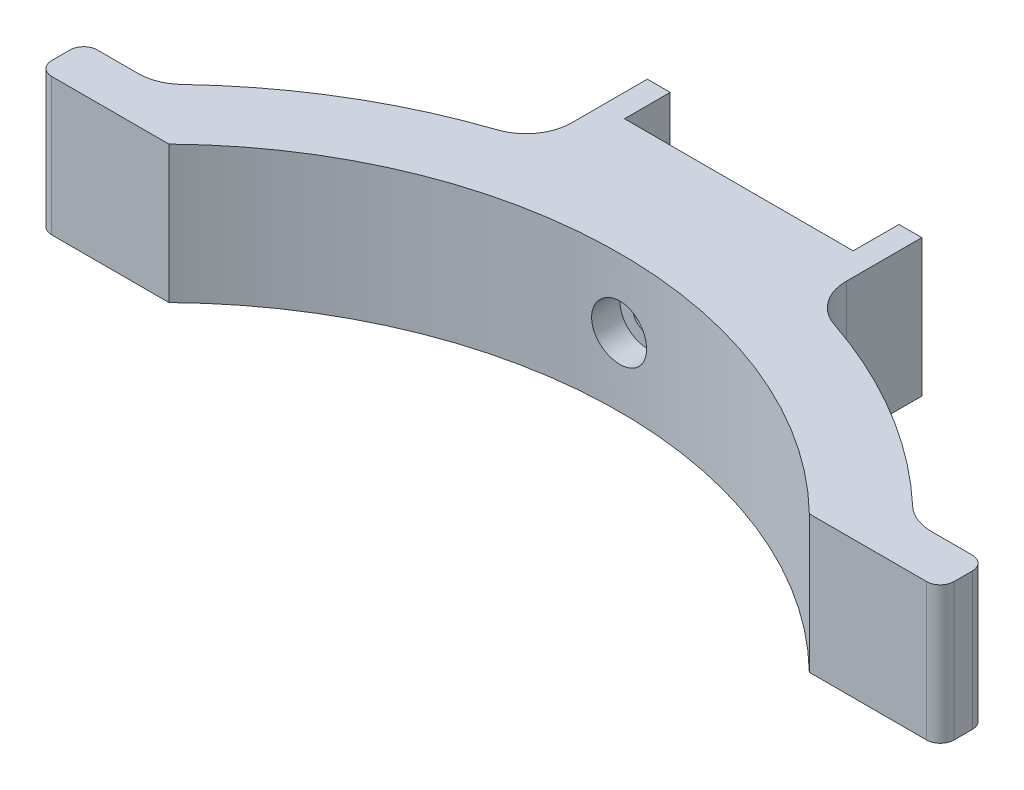
ISO-10303-21;
HEADER;
FILE_DESCRIPTION(('STEP AP214'),'2;1');
FILE_NAME('part.step','',(''),(''),'','','');
FILE_SCHEMA(('AUTOMOTIVE_DESIGN { 1 0 10303 214 1 1 1 1 }'));
ENDSEC;
DATA;
#1=APPLICATION_CONTEXT('core data for automotive mechanical design processes');
#2=APPLICATION_PROTOCOL_DEFINITION('international standard','automotive_design',2000,#1);
#3=PRODUCT_CONTEXT('',#1,'mechanical');
#4=PRODUCT('Part','Part','',(#3));
#5=PRODUCT_RELATED_PRODUCT_CATEGORY('part','',(#4));
#6=PRODUCT_DEFINITION_FORMATION('','',#4);
#7=PRODUCT_DEFINITION_CONTEXT('part definition',#1,'design');
#8=PRODUCT_DEFINITION('design','',#6,#7);
#9=PRODUCT_DEFINITION_SHAPE('','',#8);
#10=(LENGTH_UNIT() NAMED_UNIT(*) SI_UNIT(.MILLI.,.METRE.));
#11=(NAMED_UNIT(*) PLANE_ANGLE_UNIT() SI_UNIT($,.RADIAN.));
#12=(NAMED_UNIT(*) SI_UNIT($,.STERADIAN.) SOLID_ANGLE_UNIT());
#13=UNCERTAINTY_MEASURE_WITH_UNIT(LENGTH_MEASURE(1.E-05),#10,'distance_accuracy_value','');
#14=(GEOMETRIC_REPRESENTATION_CONTEXT(3) GLOBAL_UNCERTAINTY_ASSIGNED_CONTEXT((#13)) GLOBAL_UNIT_ASSIGNED_CONTEXT((#10,
#11,#12)) REPRESENTATION_CONTEXT('',''));
#15=CARTESIAN_POINT('',(0.,0.,0.));
#16=DIRECTION('',(0.,0.,1.));
#17=DIRECTION('',(1.,0.,0.));
#18=AXIS2_PLACEMENT_3D('',#15,#16,#17);
#19=CARTESIAN_POINT('',(-35.,7.5,0.));
#20=DIRECTION('',(0.,0.,-1.));
#21=DIRECTION('',(-1.,0.,0.));
#22=AXIS2_PLACEMENT_3D('',#19,#20,#21);
#23=CYLINDRICAL_SURFACE('',#22,1.6);
#24=CARTESIAN_POINT('',(-35.,7.5,-27.2928578572857));
#25=DIRECTION('',(0.,0.,-1.));
#26=DIRECTION('',(-1.,0.,0.));
#27=AXIS2_PLACEMENT_3D('',#24,#25,#26);
#28=CIRCLE('',#27,1.6);
#29=CARTESIAN_POINT('',(-36.6,7.5,-27.2928578572857));
#30=VERTEX_POINT('',#29);
#31=EDGE_CURVE('E234',#30,#30,#28,.T.);
#32=ORIENTED_EDGE('',*,*,#31,.T.);
#33=EDGE_LOOP('',(#32));
#34=FACE_BOUND('',#33,.T.);
#35=CARTESIAN_POINT('',(-35.,7.5,-17.2928578572857));
#36=DIRECTION('',(0.,0.,1.));
#37=DIRECTION('',(1.,0.,0.));
#38=AXIS2_PLACEMENT_3D('',#35,#36,#37);
#39=CIRCLE('',#38,1.6);
#40=CARTESIAN_POINT('',(-33.4,7.5,-17.2928578572857));
#41=VERTEX_POINT('',#40);
#42=EDGE_CURVE('E386',#41,#41,#39,.F.);
#43=ORIENTED_EDGE('',*,*,#42,.F.);
#44=EDGE_LOOP('',(#43));
#45=FACE_BOUND('',#44,.T.);
#46=ADVANCED_FACE('F37',(#34,#45),#23,.F.);
#47=CARTESIAN_POINT('',(0.,15.,-32.2928578572858));
#48=DIRECTION('',(0.,0.,-1.));
#49=DIRECTION('',(-1.,0.,0.));
#50=AXIS2_PLACEMENT_3D('',#47,#48,#49);
#51=PLANE('',#50);
#52=DIRECTION('',(0.,1.,0.));
#53=VECTOR('',#52,1.);
#54=CARTESIAN_POINT('',(-47.5,0.,-32.2928578572858));
#55=LINE('',#54,#53);
#56=CARTESIAN_POINT('',(-47.5,0.,-32.2928578572858));
#57=VERTEX_POINT('',#56);
#58=CARTESIAN_POINT('',(-47.5,15.,-32.2928578572858));
#59=VERTEX_POINT('',#58);
#60=EDGE_CURVE('E240',#57,#59,#55,.T.);
#61=ORIENTED_EDGE('',*,*,#60,.F.);
#62=DIRECTION('',(1.,0.,0.));
#63=VECTOR('',#62,1.);
#64=CARTESIAN_POINT('',(0.,0.,-32.2928578572858));
#65=LINE('',#64,#63);
#66=CARTESIAN_POINT('',(-50.,0.,-32.2928578572858));
#67=VERTEX_POINT('',#66);
#68=EDGE_CURVE('E228',#67,#57,#65,.T.);
#69=ORIENTED_EDGE('',*,*,#68,.F.);
#70=DIRECTION('',(0.,-1.,0.));
#71=VECTOR('',#70,1.);
#72=CARTESIAN_POINT('',(-50.,15.,-32.2928578572858));
#73=LINE('',#72,#71);
#74=CARTESIAN_POINT('',(-50.,15.,-32.2928578572858));
#75=VERTEX_POINT('',#74);
#76=EDGE_CURVE('E280',#75,#67,#73,.T.);
#77=ORIENTED_EDGE('',*,*,#76,.F.);
#78=DIRECTION('',(1.,0.,0.));
#79=VECTOR('',#78,1.);
#80=CARTESIAN_POINT('',(0.,15.,-32.2928578572858));
#81=LINE('',#80,#79);
#82=EDGE_CURVE('E274',#75,#59,#81,.T.);
#83=ORIENTED_EDGE('',*,*,#82,.T.);
#84=EDGE_LOOP('',(#61,#69,#77,#83));
#85=FACE_BOUND('',#84,.T.);
#86=ADVANCED_FACE('F409',(#85),#51,.T.);
#87=CARTESIAN_POINT('',(-35.,15.,35.7071421427143));
#88=DIRECTION('',(0.,-1.,0.));
#89=DIRECTION('',(0.,0.,-1.));
#90=AXIS2_PLACEMENT_3D('',#87,#88,#89);
#91=CYLINDRICAL_SURFACE('',#90,58.);
#92=CARTESIAN_POINT('',(-35.,0.,35.7071421427143));
#93=DIRECTION('',(0.,1.,0.));
#94=DIRECTION('',(0.,0.,1.));
#95=AXIS2_PLACEMENT_3D('',#92,#93,#94);
#96=CIRCLE('',#95,58.);
#97=CARTESIAN_POINT('',(-74.9162624278333,0.,-6.37244903629251));
#98=VERTEX_POINT('',#97);
#99=CARTESIAN_POINT('',(-53.4126984126984,0.,-19.2926081945647));
#100=VERTEX_POINT('',#99);
#101=EDGE_CURVE('E242',#98,#100,#96,.F.);
#102=ORIENTED_EDGE('',*,*,#101,.F.);
#103=DIRECTION('',(0.,-1.,0.));
#104=VECTOR('',#103,1.);
#105=CARTESIAN_POINT('',(-74.9162624278333,15.,-6.37244903629251));
#106=LINE('',#105,#104);
#107=CARTESIAN_POINT('',(-74.9162624278333,15.,-6.37244903629251));
#108=VERTEX_POINT('',#107);
#109=EDGE_CURVE('E333',#98,#108,#106,.F.);
#110=ORIENTED_EDGE('',*,*,#109,.T.);
#111=CARTESIAN_POINT('',(-35.,15.,35.7071421427143));
#112=DIRECTION('',(0.,1.,0.));
#113=DIRECTION('',(0.,0.,1.));
#114=AXIS2_PLACEMENT_3D('',#111,#112,#113);
#115=CIRCLE('',#114,58.);
#116=CARTESIAN_POINT('',(-53.4126984126984,15.,-19.2926081945647));
#117=VERTEX_POINT('',#116);
#118=EDGE_CURVE('E247',#108,#117,#115,.F.);
#119=ORIENTED_EDGE('',*,*,#118,.T.);
#120=DIRECTION('',(0.,-1.,0.));
#121=VECTOR('',#120,1.);
#122=CARTESIAN_POINT('',(-53.4126984126984,15.,-19.2926081945647));
#123=LINE('',#122,#121);
#124=EDGE_CURVE('E330',#117,#100,#123,.T.);
#125=ORIENTED_EDGE('',*,*,#124,.T.);
#126=EDGE_LOOP('',(#102,#110,#119,#125));
#127=FACE_BOUND('',#126,.T.);
#128=ADVANCED_FACE('F415',(#127),#91,.T.);
#129=CARTESIAN_POINT('',(0.,15.,-4.99999999999998));
#130=DIRECTION('',(0.,0.,1.));
#131=DIRECTION('',(1.,0.,0.));
#132=AXIS2_PLACEMENT_3D('',#129,#130,#131);
#133=PLANE('',#132);
#134=DIRECTION('',(-1.,0.,0.));
#135=VECTOR('',#134,1.);
#136=CARTESIAN_POINT('',(0.,0.,-4.99999999999998));
#137=LINE('',#136,#135);
#138=CARTESIAN_POINT('',(-78.357319533681,0.,-5.));
#139=VERTEX_POINT('',#138);
#140=CARTESIAN_POINT('',(-82.8149921768461,0.,-5.));
#141=VERTEX_POINT('',#140);
#142=EDGE_CURVE('E283',#139,#141,#137,.T.);
#143=ORIENTED_EDGE('',*,*,#142,.T.);
#144=DIRECTION('',(0.,-1.,0.));
#145=VECTOR('',#144,1.);
#146=CARTESIAN_POINT('',(-82.8149921768461,15.,-5.));
#147=LINE('',#146,#145);
#148=CARTESIAN_POINT('',(-82.8149921768461,15.,-5.));
#149=VERTEX_POINT('',#148);
#150=EDGE_CURVE('E379',#141,#149,#147,.F.);
#151=ORIENTED_EDGE('',*,*,#150,.T.);
#152=DIRECTION('',(-1.,0.,0.));
#153=VECTOR('',#152,1.);
#154=CARTESIAN_POINT('',(0.,15.,-4.99999999999998));
#155=LINE('',#154,#153);
#156=CARTESIAN_POINT('',(-78.357319533681,15.,-5.));
#157=VERTEX_POINT('',#156);
#158=EDGE_CURVE('E250',#157,#149,#155,.T.);
#159=ORIENTED_EDGE('',*,*,#158,.F.);
#160=DIRECTION('',(0.,-1.,0.));
#161=VECTOR('',#160,1.);
#162=CARTESIAN_POINT('',(-78.357319533681,15.,-5.));
#163=LINE('',#162,#161);
#164=EDGE_CURVE('E327',#157,#139,#163,.T.);
#165=ORIENTED_EDGE('',*,*,#164,.T.);
#166=EDGE_LOOP('',(#143,#151,#159,#165));
#167=FACE_BOUND('',#166,.T.);
#168=ADVANCED_FACE('F470',(#167),#133,.F.);
#169=CARTESIAN_POINT('',(-84.3149921768461,15.,0.));
#170=DIRECTION('',(1.,0.,0.));
#171=DIRECTION('',(0.,0.,-1.));
#172=AXIS2_PLACEMENT_3D('',#169,#170,#171);
#173=PLANE('',#172);
#174=DIRECTION('',(0.,0.,1.));
#175=VECTOR('',#174,1.);
#176=CARTESIAN_POINT('',(-84.3149921768461,0.,0.));
#177=LINE('',#176,#175);
#178=CARTESIAN_POINT('',(-84.3149921768461,0.,-3.5));
#179=VERTEX_POINT('',#178);
#180=CARTESIAN_POINT('',(-84.3149921768461,0.,-1.5));
#181=VERTEX_POINT('',#180);
#182=EDGE_CURVE('E287',#179,#181,#177,.T.);
#183=ORIENTED_EDGE('',*,*,#182,.T.);
#184=DIRECTION('',(0.,-1.,0.));
#185=VECTOR('',#184,1.);
#186=CARTESIAN_POINT('',(-84.3149921768461,15.,-1.5));
#187=LINE('',#186,#185);
#188=CARTESIAN_POINT('',(-84.3149921768461,15.,-1.5));
#189=VERTEX_POINT('',#188);
#190=EDGE_CURVE('E370',#181,#189,#187,.F.);
#191=ORIENTED_EDGE('',*,*,#190,.T.);
#192=DIRECTION('',(0.,0.,1.));
#193=VECTOR('',#192,1.);
#194=CARTESIAN_POINT('',(-84.3149921768461,15.,0.));
#195=LINE('',#194,#193);
#196=CARTESIAN_POINT('',(-84.3149921768461,15.,-3.5));
#197=VERTEX_POINT('',#196);
#198=EDGE_CURVE('E255',#197,#189,#195,.T.);
#199=ORIENTED_EDGE('',*,*,#198,.F.);
#200=DIRECTION('',(0.,-1.,0.));
#201=VECTOR('',#200,1.);
#202=CARTESIAN_POINT('',(-84.3149921768461,15.,-3.5));
#203=LINE('',#202,#201);
#204=EDGE_CURVE('E367',#197,#179,#203,.T.);
#205=ORIENTED_EDGE('',*,*,#204,.T.);
#206=EDGE_LOOP('',(#183,#191,#199,#205));
#207=FACE_BOUND('',#206,.T.);
#208=ADVANCED_FACE('F466',(#207),#173,.F.);
#209=CARTESIAN_POINT('',(0.,15.,0.));
#210=DIRECTION('',(0.,0.,-1.));
#211=DIRECTION('',(-1.,0.,0.));
#212=AXIS2_PLACEMENT_3D('',#209,#210,#211);
#213=PLANE('',#212);
#214=DIRECTION('',(1.,0.,0.));
#215=VECTOR('',#214,1.);
#216=CARTESIAN_POINT('',(0.,15.,0.));
#217=LINE('',#216,#215);
#218=CARTESIAN_POINT('',(-82.8149921768461,15.,0.));
#219=VERTEX_POINT('',#218);
#220=CARTESIAN_POINT('',(-70.,15.,0.));
#221=VERTEX_POINT('',#220);
#222=EDGE_CURVE('E258',#219,#221,#217,.T.);
#223=ORIENTED_EDGE('',*,*,#222,.F.);
#224=DIRECTION('',(0.,-1.,0.));
#225=VECTOR('',#224,1.);
#226=CARTESIAN_POINT('',(-82.8149921768461,15.,0.));
#227=LINE('',#226,#225);
#228=CARTESIAN_POINT('',(-82.8149921768461,0.,0.));
#229=VERTEX_POINT('',#228);
#230=EDGE_CURVE('E356',#219,#229,#227,.T.);
#231=ORIENTED_EDGE('',*,*,#230,.T.);
#232=DIRECTION('',(1.,0.,0.));
#233=VECTOR('',#232,1.);
#234=CARTESIAN_POINT('',(0.,0.,0.));
#235=LINE('',#234,#233);
#236=CARTESIAN_POINT('',(-70.,0.,0.));
#237=VERTEX_POINT('',#236);
#238=EDGE_CURVE('E290',#229,#237,#235,.T.);
#239=ORIENTED_EDGE('',*,*,#238,.T.);
#240=DIRECTION('',(0.,-1.,0.));
#241=VECTOR('',#240,1.);
#242=CARTESIAN_POINT('',(-70.,15.,0.));
#243=LINE('',#242,#241);
#244=EDGE_CURVE('E317',#221,#237,#243,.T.);
#245=ORIENTED_EDGE('',*,*,#244,.F.);
#246=EDGE_LOOP('',(#223,#231,#239,#245));
#247=FACE_BOUND('',#246,.T.);
#248=ADVANCED_FACE('F462',(#247),#213,.F.);
#249=CARTESIAN_POINT('',(-35.,15.,35.7071421427143));
#250=DIRECTION('',(0.,-1.,0.));
#251=DIRECTION('',(0.,0.,-1.));
#252=AXIS2_PLACEMENT_3D('',#249,#250,#251);
#253=CYLINDRICAL_SURFACE('',#252,50.);
#254=CARTESIAN_POINT('',(-32.,7.5,-14.2027767111569));
#255=CARTESIAN_POINT('',(-32.0000074126429,7.66834851500796,-14.2027779173491));
#256=CARTESIAN_POINT('',(-32.0142182255217,7.83681523704035,-14.2036376412121));
#257=CARTESIAN_POINT('',(-32.070704515842,8.16909784742341,-14.2069840899649));
#258=CARTESIAN_POINT('',(-32.1130127467532,8.33290807497459,-14.2094727136323));
#259=CARTESIAN_POINT('',(-32.2244751100488,8.65101638142346,-14.215794062862));
#260=CARTESIAN_POINT('',(-32.2936151774535,8.80531939488397,-14.2196260841273));
#261=CARTESIAN_POINT('',(-32.4567560762598,9.10008901450537,-14.2282015550612));
#262=CARTESIAN_POINT('',(-32.550751176806,9.24055879997698,-14.2329447945602));
#263=CARTESIAN_POINT('',(-32.7610782359146,9.5039113338983,-14.2428157517169));
#264=CARTESIAN_POINT('',(-32.8774375224599,9.62677224113994,-14.2479439350367));
#265=CARTESIAN_POINT('',(-33.1291338642861,9.85123266182081,-14.2580026036015));
#266=CARTESIAN_POINT('',(-33.2644717070366,9.95283129259662,-14.2629330806322));
#267=CARTESIAN_POINT('',(-33.5504046495832,10.1319486820872,-14.2720446989564));
#268=CARTESIAN_POINT('',(-33.701010932928,10.2094496186989,-14.2762252846852));
#269=CARTESIAN_POINT('',(-34.0131270968661,10.3380574838814,-14.2833611914971));
#270=CARTESIAN_POINT('',(-34.1746368681849,10.3891646769251,-14.2863165248575));
#271=CARTESIAN_POINT('',(-34.5037671344434,10.4634743912151,-14.2906657288223));
#272=CARTESIAN_POINT('',(-34.6713799612553,10.4867107632927,-14.2920614934777));
#273=CARTESIAN_POINT('',(-35.008132393482,10.5047237618644,-14.2931406581224));
#274=CARTESIAN_POINT('',(-35.1772719827989,10.4995006880759,-14.2928240761452));
#275=CARTESIAN_POINT('',(-35.5120474182026,10.4607710179149,-14.290515804139));
#276=CARTESIAN_POINT('',(-35.6776874943814,10.4273008396841,-14.2885262710076));
#277=CARTESIAN_POINT('',(-36.0009940116487,10.333083557326,-14.283098592828));
#278=CARTESIAN_POINT('',(-36.158660408559,10.2723363020886,-14.2796604397548));
#279=CARTESIAN_POINT('',(-36.4616609796574,10.1252479570604,-14.2717189592381));
#280=CARTESIAN_POINT('',(-36.6069871140227,10.0388903439208,-14.2672149444997));
#281=CARTESIAN_POINT('',(-36.8810940674377,9.84304468960387,-14.2576487036315));
#282=CARTESIAN_POINT('',(-37.0098747153707,9.7335564092356,-14.2525864717296));
#283=CARTESIAN_POINT('',(-37.2474476095389,9.49435166581447,-14.2424641758901));
#284=CARTESIAN_POINT('',(-37.3562080352986,9.36460359617032,-14.2374041279418));
#285=CARTESIAN_POINT('',(-37.5504078806733,9.08867314529296,-14.2278646507134));
#286=CARTESIAN_POINT('',(-37.6358472917606,8.94249075805027,-14.2233852216458));
#287=CARTESIAN_POINT('',(-37.7809774184875,8.63782124992027,-14.2155127660071));
#288=CARTESIAN_POINT('',(-37.8406668251299,8.47933350397517,-14.2121197946683));
#289=CARTESIAN_POINT('',(-37.9325807658974,8.15456130681087,-14.2068048851309));
#290=CARTESIAN_POINT('',(-37.9648055976735,7.98827694010918,-14.20488293099));
#291=CARTESIAN_POINT('',(-38.0008360624559,7.65290918846178,-14.2027297779876));
#292=CARTESIAN_POINT('',(-38.00468591307,7.48383057021174,-14.2024959484811));
#293=CARTESIAN_POINT('',(-37.9839726323076,7.14742991891693,-14.2037385429101));
#294=CARTESIAN_POINT('',(-37.9594096370208,6.98010787746252,-14.2052149586541));
#295=CARTESIAN_POINT('',(-37.8826046361301,6.65209489821447,-14.2097092535134));
#296=CARTESIAN_POINT('',(-37.8303829677351,6.4913991815897,-14.2127259999769));
#297=CARTESIAN_POINT('',(-37.6997635980336,6.1810529754805,-14.2199600191421));
#298=CARTESIAN_POINT('',(-37.6213656779736,6.03140257831397,-14.2241773018765));
#299=CARTESIAN_POINT('',(-37.4405061331126,5.74719185710485,-14.2333435115505));
#300=CARTESIAN_POINT('',(-37.338014864049,5.61265042680334,-14.2382933370028));
#301=CARTESIAN_POINT('',(-37.1119211530436,5.36266704611566,-14.2483636617502));
#302=CARTESIAN_POINT('',(-36.9883185200426,5.24722526860115,-14.2534841625894));
#303=CARTESIAN_POINT('',(-36.7233204847152,5.03856897183482,-14.2633264916511));
#304=CARTESIAN_POINT('',(-36.5819025394137,4.9453830549062,-14.2680478018725));
#305=CARTESIAN_POINT('',(-36.2854017066771,4.78407936716542,-14.2765522920794));
#306=CARTESIAN_POINT('',(-36.1303188981623,4.7159614515867,-14.2803354774824));
#307=CARTESIAN_POINT('',(-35.8109959952124,4.60677719297666,-14.286534943987));
#308=CARTESIAN_POINT('',(-35.6467621234427,4.56569270511091,-14.2889521417853));
#309=CARTESIAN_POINT('',(-35.3137124435243,4.51168215005503,-14.292150909441));
#310=CARTESIAN_POINT('',(-35.1448966762788,4.49875583157688,-14.292932493895));
#311=CARTESIAN_POINT('',(-34.8077585335077,4.50143095968146,-14.2927720133574));
#312=CARTESIAN_POINT('',(-34.6394357995064,4.51698762213074,-14.2918326542247));
#313=CARTESIAN_POINT('',(-34.3077968618993,4.57609432098125,-14.2883413114521));
#314=CARTESIAN_POINT('',(-34.144480667249,4.61964440745322,-14.2857893249278));
#315=CARTESIAN_POINT('',(-33.8274834984612,4.73349180325337,-14.2793596279586));
#316=CARTESIAN_POINT('',(-33.6738024909268,4.80378901986656,-14.2754819221091));
#317=CARTESIAN_POINT('',(-33.3804190108313,4.96912871185856,-14.2668363210219));
#318=CARTESIAN_POINT('',(-33.2407161613912,5.06417051982503,-14.2620684497948));
#319=CARTESIAN_POINT('',(-32.9790280774797,5.27646617125653,-14.25217005238));
#320=CARTESIAN_POINT('',(-32.8570689717361,5.39375219719127,-14.2470390075869));
#321=CARTESIAN_POINT('',(-32.6345297287572,5.64716738910832,-14.2369966014822));
#322=CARTESIAN_POINT('',(-32.5339548369549,5.78330116485217,-14.2320852943038));
#323=CARTESIAN_POINT('',(-32.3569704773385,6.07069248995209,-14.2230319200712));
#324=CARTESIAN_POINT('',(-32.2805896482858,6.2219676858121,-14.2188907670316));
#325=CARTESIAN_POINT('',(-32.1544039551781,6.53510923970906,-14.211858394132));
#326=CARTESIAN_POINT('',(-32.1045679067453,6.69696291811898,-14.2089657083546));
#327=CARTESIAN_POINT('',(-32.045865327022,6.96650850653592,-14.2055173136294));
#328=CARTESIAN_POINT('',(-32.0286880089385,7.07245726973714,-14.2044941671315));
#329=CARTESIAN_POINT('',(-32.0057529919403,7.28558803715451,-14.2031234821815));
#330=CARTESIAN_POINT('',(-31.9999952785006,7.39277003980188,-14.2027759428701));
#331=CARTESIAN_POINT('',(-32.,7.5,-14.2027767111569));
#332=B_SPLINE_CURVE_WITH_KNOTS('',3,(#254,#255,#256,#257,#258,#259,#260,#261,#262,#263,#264,
#265,#266,#267,#268,#269,#270,#271,#272,#273,#274,#275,#276,#277,#278,#279,#280,#281,#282,#283,
#284,#285,#286,#287,#288,#289,#290,#291,#292,#293,#294,#295,#296,#297,#298,#299,#300,#301,#302,
#303,#304,#305,#306,#307,#308,#309,#310,#311,#312,#313,#314,#315,#316,#317,#318,#319,#320,#321,
#322,#323,#324,#325,#326,#327,#328,#329,#330,#331),.UNSPECIFIED.,.T.,.F.,(4,2,2,2,2,2,2,2,2,2,2,
2,2,2,2,2,2,2,2,2,2,2,2,2,2,2,2,2,2,2,2,2,2,2,2,2,2,2,4),(0.,0.50465409441083,1.00989750469077,
1.51487642839874,2.01973901987436,2.52522249762361,3.03072695540781,3.53660438832692,
4.04247675211105,4.54773407852321,5.05298608388374,5.5575876764176,6.06219206439061,
6.56712272507959,7.07205860744166,7.5777902413209,8.08352206012947,8.58927958470435,
9.0950316279961,9.59999537532428,10.1049567040272,10.6095472529766,11.1141420188672,
11.619360913985,12.1245843816075,12.630453689427,13.1363200758289,13.6418465774614,
14.147368567676,14.6520964020586,15.1568251392307,15.6615521268506,16.1662655023596,
16.6717147352076,17.1772878093688,17.6834571183417,18.1890304689197,18.5104714230321,
18.8319119682899),.UNSPECIFIED.);
#333=CARTESIAN_POINT('',(-32.,7.5,-14.2027767111569));
#334=VERTEX_POINT('',#333);
#335=EDGE_CURVE('E41',#334,#334,#332,.T.);
#336=ORIENTED_EDGE('',*,*,#335,.F.);
#337=EDGE_LOOP('',(#336));
#338=FACE_BOUND('',#337,.T.);
#339=CARTESIAN_POINT('',(-35.,0.,35.7071421427143));
#340=DIRECTION('',(0.,1.,0.));
#341=DIRECTION('',(0.,0.,1.));
#342=AXIS2_PLACEMENT_3D('',#339,#340,#341);
#343=CIRCLE('',#342,50.);
#344=CARTESIAN_POINT('',(0.,0.,0.));
#345=VERTEX_POINT('',#344);
#346=EDGE_CURVE('E292',#345,#237,#343,.T.);
#347=ORIENTED_EDGE('',*,*,#346,.F.);
#348=DIRECTION('',(0.,-1.,0.));
#349=VECTOR('',#348,1.);
#350=CARTESIAN_POINT('',(0.,15.,0.));
#351=LINE('',#350,#349);
#352=CARTESIAN_POINT('',(0.,15.,0.));
#353=VERTEX_POINT('',#352);
#354=EDGE_CURVE('E314',#353,#345,#351,.T.);
#355=ORIENTED_EDGE('',*,*,#354,.F.);
#356=CARTESIAN_POINT('',(-35.,15.,35.7071421427143));
#357=DIRECTION('',(0.,1.,0.));
#358=DIRECTION('',(0.,0.,1.));
#359=AXIS2_PLACEMENT_3D('',#356,#357,#358);
#360=CIRCLE('',#359,50.);
#361=EDGE_CURVE('E260',#353,#221,#360,.T.);
#362=ORIENTED_EDGE('',*,*,#361,.T.);
#363=ORIENTED_EDGE('',*,*,#244,.T.);
#364=EDGE_LOOP('',(#347,#355,#362,#363));
#365=FACE_BOUND('',#364,.T.);
#366=ADVANCED_FACE('F457',(#338,#365),#253,.F.);
#367=CARTESIAN_POINT('',(0.,15.,0.));
#368=DIRECTION('',(0.,0.,1.));
#369=DIRECTION('',(1.,0.,0.));
#370=AXIS2_PLACEMENT_3D('',#367,#368,#369);
#371=PLANE('',#370);
#372=DIRECTION('',(-1.,0.,0.));
#373=VECTOR('',#372,1.);
#374=CARTESIAN_POINT('',(0.,0.,0.));
#375=LINE('',#374,#373);
#376=CARTESIAN_POINT('',(12.8149921768461,0.,0.));
#377=VERTEX_POINT('',#376);
#378=EDGE_CURVE('E295',#377,#345,#375,.T.);
#379=ORIENTED_EDGE('',*,*,#378,.F.);
#380=DIRECTION('',(0.,-1.,0.));
#381=VECTOR('',#380,1.);
#382=CARTESIAN_POINT('',(12.8149921768461,15.,0.));
#383=LINE('',#382,#381);
#384=CARTESIAN_POINT('',(12.8149921768461,15.,0.));
#385=VERTEX_POINT('',#384);
#386=EDGE_CURVE('E51',#377,#385,#383,.F.);
#387=ORIENTED_EDGE('',*,*,#386,.T.);
#388=DIRECTION('',(-1.,0.,0.));
#389=VECTOR('',#388,1.);
#390=CARTESIAN_POINT('',(0.,15.,0.));
#391=LINE('',#390,#389);
#392=EDGE_CURVE('E263',#385,#353,#391,.T.);
#393=ORIENTED_EDGE('',*,*,#392,.T.);
#394=ORIENTED_EDGE('',*,*,#354,.T.);
#395=EDGE_LOOP('',(#379,#387,#393,#394));
#396=FACE_BOUND('',#395,.T.);
#397=ADVANCED_FACE('F454',(#396),#371,.T.);
#398=CARTESIAN_POINT('',(14.3149921768461,15.,0.));
#399=DIRECTION('',(1.,0.,0.));
#400=DIRECTION('',(0.,0.,-1.));
#401=AXIS2_PLACEMENT_3D('',#398,#399,#400);
#402=PLANE('',#401);
#403=DIRECTION('',(0.,0.,1.));
#404=VECTOR('',#403,1.);
#405=CARTESIAN_POINT('',(14.3149921768461,15.,0.));
#406=LINE('',#405,#404);
#407=CARTESIAN_POINT('',(14.3149921768461,15.,-3.50000000000001));
#408=VERTEX_POINT('',#407);
#409=CARTESIAN_POINT('',(14.3149921768461,15.,-1.50000000000001));
#410=VERTEX_POINT('',#409);
#411=EDGE_CURVE('E265',#408,#410,#406,.T.);
#412=ORIENTED_EDGE('',*,*,#411,.T.);
#413=DIRECTION('',(0.,-1.,0.));
#414=VECTOR('',#413,1.);
#415=CARTESIAN_POINT('',(14.3149921768461,15.,-1.50000000000001));
#416=LINE('',#415,#414);
#417=CARTESIAN_POINT('',(14.3149921768461,0.,-1.50000000000001));
#418=VERTEX_POINT('',#417);
#419=EDGE_CURVE('E383',#410,#418,#416,.T.);
#420=ORIENTED_EDGE('',*,*,#419,.T.);
#421=DIRECTION('',(0.,0.,1.));
#422=VECTOR('',#421,1.);
#423=CARTESIAN_POINT('',(14.3149921768461,0.,0.));
#424=LINE('',#423,#422);
#425=CARTESIAN_POINT('',(14.3149921768461,0.,-3.50000000000001));
#426=VERTEX_POINT('',#425);
#427=EDGE_CURVE('E297',#426,#418,#424,.T.);
#428=ORIENTED_EDGE('',*,*,#427,.F.);
#429=DIRECTION('',(0.,-1.,0.));
#430=VECTOR('',#429,1.);
#431=CARTESIAN_POINT('',(14.3149921768461,15.,-3.50000000000001));
#432=LINE('',#431,#430);
#433=EDGE_CURVE('E381',#426,#408,#432,.F.);
#434=ORIENTED_EDGE('',*,*,#433,.T.);
#435=EDGE_LOOP('',(#412,#420,#428,#434));
#436=FACE_BOUND('',#435,.T.);
#437=ADVANCED_FACE('F450',(#436),#402,.T.);
#438=CARTESIAN_POINT('',(0.,15.,-5.00000000000001));
#439=DIRECTION('',(0.,0.,-1.));
#440=DIRECTION('',(-1.,0.,0.));
#441=AXIS2_PLACEMENT_3D('',#438,#439,#440);
#442=PLANE('',#441);
#443=DIRECTION('',(1.,0.,0.));
#444=VECTOR('',#443,1.);
#445=CARTESIAN_POINT('',(0.,15.,-5.00000000000001));
#446=LINE('',#445,#444);
#447=CARTESIAN_POINT('',(8.35731953368097,15.,-5.00000000000001));
#448=VERTEX_POINT('',#447);
#449=CARTESIAN_POINT('',(12.8149921768461,15.,-5.00000000000001));
#450=VERTEX_POINT('',#449);
#451=EDGE_CURVE('E268',#448,#450,#446,.T.);
#452=ORIENTED_EDGE('',*,*,#451,.T.);
#453=DIRECTION('',(0.,-1.,0.));
#454=VECTOR('',#453,1.);
#455=CARTESIAN_POINT('',(12.8149921768461,15.,-5.00000000000001));
#456=LINE('',#455,#454);
#457=CARTESIAN_POINT('',(12.8149921768461,0.,-5.00000000000001));
#458=VERTEX_POINT('',#457);
#459=EDGE_CURVE('E12',#450,#458,#456,.T.);
#460=ORIENTED_EDGE('',*,*,#459,.T.);
#461=DIRECTION('',(1.,0.,0.));
#462=VECTOR('',#461,1.);
#463=CARTESIAN_POINT('',(0.,0.,-5.00000000000001));
#464=LINE('',#463,#462);
#465=CARTESIAN_POINT('',(8.35731953368097,0.,-5.00000000000001));
#466=VERTEX_POINT('',#465);
#467=EDGE_CURVE('E300',#466,#458,#464,.T.);
#468=ORIENTED_EDGE('',*,*,#467,.F.);
#469=DIRECTION('',(0.,1.,0.));
#470=VECTOR('',#469,1.);
#471=CARTESIAN_POINT('',(8.35731953368097,15.,-5.00000000000001));
#472=LINE('',#471,#470);
#473=EDGE_CURVE('E325',#466,#448,#472,.T.);
#474=ORIENTED_EDGE('',*,*,#473,.T.);
#475=EDGE_LOOP('',(#452,#460,#468,#474));
#476=FACE_BOUND('',#475,.T.);
#477=ADVANCED_FACE('F446',(#476),#442,.T.);
#478=CARTESIAN_POINT('',(-16.5873015873016,15.,-19.2926081945647));
#479=VERTEX_POINT('',#478);
#480=CARTESIAN_POINT('',(4.91626242783327,15.,-6.37244903629253));
#481=VERTEX_POINT('',#480);
#482=EDGE_CURVE('E252',#479,#481,#115,.F.);
#483=ORIENTED_EDGE('',*,*,#482,.T.);
#484=DIRECTION('',(0.,-1.,0.));
#485=VECTOR('',#484,1.);
#486=CARTESIAN_POINT('',(4.91626242783327,15.,-6.37244903629253));
#487=LINE('',#486,#485);
#488=CARTESIAN_POINT('',(4.91626242783327,0.,-6.37244903629253));
#489=VERTEX_POINT('',#488);
#490=EDGE_CURVE('E322',#481,#489,#487,.T.);
#491=ORIENTED_EDGE('',*,*,#490,.T.);
#492=CARTESIAN_POINT('',(-16.5873015873016,0.,-19.2926081945647));
#493=VERTEX_POINT('',#492);
#494=EDGE_CURVE('E284',#493,#489,#96,.F.);
#495=ORIENTED_EDGE('',*,*,#494,.F.);
#496=DIRECTION('',(0.,-1.,0.));
#497=VECTOR('',#496,1.);
#498=CARTESIAN_POINT('',(-16.5873015873016,15.,-19.2926081945647));
#499=LINE('',#498,#497);
#500=EDGE_CURVE('E320',#493,#479,#499,.F.);
#501=ORIENTED_EDGE('',*,*,#500,.T.);
#502=EDGE_LOOP('',(#483,#491,#495,#501));
#503=FACE_BOUND('',#502,.T.);
#504=ADVANCED_FACE('F442',(#503),#91,.T.);
#505=CARTESIAN_POINT('',(-20.,15.,0.));
#506=DIRECTION('',(1.,0.,0.));
#507=DIRECTION('',(0.,0.,-1.));
#508=AXIS2_PLACEMENT_3D('',#505,#506,#507);
#509=PLANE('',#508);
#510=DIRECTION('',(0.,0.,1.));
#511=VECTOR('',#510,1.);
#512=CARTESIAN_POINT('',(-20.,15.,0.));
#513=LINE('',#512,#511);
#514=CARTESIAN_POINT('',(-20.,15.,-32.2928578572858));
#515=VERTEX_POINT('',#514);
#516=CARTESIAN_POINT('',(-20.,15.,-24.0339659822611));
#517=VERTEX_POINT('',#516);
#518=EDGE_CURVE('E270',#515,#517,#513,.T.);
#519=ORIENTED_EDGE('',*,*,#518,.T.);
#520=DIRECTION('',(0.,1.,0.));
#521=VECTOR('',#520,1.);
#522=CARTESIAN_POINT('',(-20.,0.,-24.0339659822611));
#523=LINE('',#522,#521);
#524=CARTESIAN_POINT('',(-20.,0.,-24.0339659822611));
#525=VERTEX_POINT('',#524);
#526=EDGE_CURVE('E337',#517,#525,#523,.F.);
#527=ORIENTED_EDGE('',*,*,#526,.T.);
#528=DIRECTION('',(0.,0.,1.));
#529=VECTOR('',#528,1.);
#530=CARTESIAN_POINT('',(-20.,0.,0.));
#531=LINE('',#530,#529);
#532=CARTESIAN_POINT('',(-20.,0.,-32.2928578572858));
#533=VERTEX_POINT('',#532);
#534=EDGE_CURVE('E303',#533,#525,#531,.T.);
#535=ORIENTED_EDGE('',*,*,#534,.F.);
#536=DIRECTION('',(0.,-1.,0.));
#537=VECTOR('',#536,1.);
#538=CARTESIAN_POINT('',(-20.,15.,-32.2928578572858));
#539=LINE('',#538,#537);
#540=EDGE_CURVE('E311',#515,#533,#539,.T.);
#541=ORIENTED_EDGE('',*,*,#540,.F.);
#542=EDGE_LOOP('',(#519,#527,#535,#541));
#543=FACE_BOUND('',#542,.T.);
#544=ADVANCED_FACE('F438',(#543),#509,.T.);
#545=DIRECTION('',(0.,1.,0.));
#546=VECTOR('',#545,1.);
#547=CARTESIAN_POINT('',(-22.5,0.,-32.2928578572858));
#548=LINE('',#547,#546);
#549=CARTESIAN_POINT('',(-22.5,0.,-32.2928578572858));
#550=VERTEX_POINT('',#549);
#551=CARTESIAN_POINT('',(-22.5,15.,-32.2928578572858));
#552=VERTEX_POINT('',#551);
#553=EDGE_CURVE('E243',#550,#552,#548,.T.);
#554=ORIENTED_EDGE('',*,*,#553,.T.);
#555=EDGE_CURVE('E273',#552,#515,#81,.T.);
#556=ORIENTED_EDGE('',*,*,#555,.T.);
#557=ORIENTED_EDGE('',*,*,#540,.T.);
#558=EDGE_CURVE('E306',#550,#533,#65,.T.);
#559=ORIENTED_EDGE('',*,*,#558,.F.);
#560=EDGE_LOOP('',(#554,#556,#557,#559));
#561=FACE_BOUND('',#560,.T.);
#562=ADVANCED_FACE('F418',(#561),#51,.T.);
#563=CARTESIAN_POINT('',(-50.,15.,0.));
#564=DIRECTION('',(1.,0.,0.));
#565=DIRECTION('',(0.,0.,-1.));
#566=AXIS2_PLACEMENT_3D('',#563,#564,#565);
#567=PLANE('',#566);
#568=DIRECTION('',(0.,0.,1.));
#569=VECTOR('',#568,1.);
#570=CARTESIAN_POINT('',(-50.,0.,0.));
#571=LINE('',#570,#569);
#572=CARTESIAN_POINT('',(-50.,0.,-24.0339659822611));
#573=VERTEX_POINT('',#572);
#574=EDGE_CURVE('E251',#67,#573,#571,.T.);
#575=ORIENTED_EDGE('',*,*,#574,.T.);
#576=DIRECTION('',(0.,-1.,0.));
#577=VECTOR('',#576,1.);
#578=CARTESIAN_POINT('',(-50.,15.,-24.0339659822611));
#579=LINE('',#578,#577);
#580=CARTESIAN_POINT('',(-50.,15.,-24.0339659822611));
#581=VERTEX_POINT('',#580);
#582=EDGE_CURVE('E335',#573,#581,#579,.F.);
#583=ORIENTED_EDGE('',*,*,#582,.T.);
#584=DIRECTION('',(0.,0.,1.));
#585=VECTOR('',#584,1.);
#586=CARTESIAN_POINT('',(-50.,15.,0.));
#587=LINE('',#586,#585);
#588=EDGE_CURVE('E277',#75,#581,#587,.T.);
#589=ORIENTED_EDGE('',*,*,#588,.F.);
#590=ORIENTED_EDGE('',*,*,#76,.T.);
#591=EDGE_LOOP('',(#575,#583,#589,#590));
#592=FACE_BOUND('',#591,.T.);
#593=ADVANCED_FACE('F430',(#592),#567,.F.);
#594=CARTESIAN_POINT('',(0.,15.,0.));
#595=DIRECTION('',(0.,1.,0.));
#596=DIRECTION('',(0.,0.,1.));
#597=AXIS2_PLACEMENT_3D('',#594,#595,#596);
#598=PLANE('',#597);
#599=DIRECTION('',(0.,0.,1.));
#600=VECTOR('',#599,1.);
#601=CARTESIAN_POINT('',(-47.5,15.,-32.2928578572858));
#602=LINE('',#601,#600);
#603=CARTESIAN_POINT('',(-47.5,15.,-27.2928578572857));
#604=VERTEX_POINT('',#603);
#605=EDGE_CURVE('E213',#59,#604,#602,.T.);
#606=ORIENTED_EDGE('',*,*,#605,.F.);
#607=ORIENTED_EDGE('',*,*,#82,.F.);
#608=ORIENTED_EDGE('',*,*,#588,.T.);
#609=CARTESIAN_POINT('',(-55.,15.,-24.0339659822611));
#610=DIRECTION('',(0.,1.,0.));
#611=DIRECTION('',(0.,0.,1.));
#612=AXIS2_PLACEMENT_3D('',#609,#610,#611);
#613=CIRCLE('',#612,5.);
#614=EDGE_CURVE('E350',#581,#117,#613,.F.);
#615=ORIENTED_EDGE('',*,*,#614,.T.);
#616=ORIENTED_EDGE('',*,*,#118,.F.);
#617=CARTESIAN_POINT('',(-78.357319533681,15.,-10.));
#618=DIRECTION('',(0.,1.,0.));
#619=DIRECTION('',(0.,0.,1.));
#620=AXIS2_PLACEMENT_3D('',#617,#618,#619);
#621=CIRCLE('',#620,5.);
#622=EDGE_CURVE('E346',#108,#157,#621,.F.);
#623=ORIENTED_EDGE('',*,*,#622,.T.);
#624=ORIENTED_EDGE('',*,*,#158,.T.);
#625=CARTESIAN_POINT('',(-82.8149921768461,15.,-3.5));
#626=DIRECTION('',(0.,1.,0.));
#627=DIRECTION('',(0.,0.,1.));
#628=AXIS2_PLACEMENT_3D('',#625,#626,#627);
#629=CIRCLE('',#628,1.5);
#630=EDGE_CURVE('E375',#149,#197,#629,.T.);
#631=ORIENTED_EDGE('',*,*,#630,.T.);
#632=ORIENTED_EDGE('',*,*,#198,.T.);
#633=CARTESIAN_POINT('',(-82.8149921768461,15.,-1.5));
#634=DIRECTION('',(0.,1.,0.));
#635=DIRECTION('',(0.,0.,1.));
#636=AXIS2_PLACEMENT_3D('',#633,#634,#635);
#637=CIRCLE('',#636,1.5);
#638=EDGE_CURVE('E377',#189,#219,#637,.T.);
#639=ORIENTED_EDGE('',*,*,#638,.T.);
#640=ORIENTED_EDGE('',*,*,#222,.T.);
#641=ORIENTED_EDGE('',*,*,#361,.F.);
#642=ORIENTED_EDGE('',*,*,#392,.F.);
#643=CARTESIAN_POINT('',(12.8149921768461,15.,-1.50000000000001));
#644=DIRECTION('',(0.,1.,0.));
#645=DIRECTION('',(0.,0.,1.));
#646=AXIS2_PLACEMENT_3D('',#643,#644,#645);
#647=CIRCLE('',#646,1.5);
#648=EDGE_CURVE('E373',#385,#410,#647,.T.);
#649=ORIENTED_EDGE('',*,*,#648,.T.);
#650=ORIENTED_EDGE('',*,*,#411,.F.);
#651=CARTESIAN_POINT('',(12.8149921768461,15.,-3.50000000000001));
#652=DIRECTION('',(0.,1.,0.));
#653=DIRECTION('',(0.,0.,1.));
#654=AXIS2_PLACEMENT_3D('',#651,#652,#653);
#655=CIRCLE('',#654,1.5);
#656=EDGE_CURVE('E67',#408,#450,#655,.T.);
#657=ORIENTED_EDGE('',*,*,#656,.T.);
#658=ORIENTED_EDGE('',*,*,#451,.F.);
#659=CARTESIAN_POINT('',(8.35731953368097,15.,-10.));
#660=DIRECTION('',(0.,1.,0.));
#661=DIRECTION('',(0.,0.,1.));
#662=AXIS2_PLACEMENT_3D('',#659,#660,#661);
#663=CIRCLE('',#662,5.);
#664=EDGE_CURVE('E342',#448,#481,#663,.F.);
#665=ORIENTED_EDGE('',*,*,#664,.T.);
#666=ORIENTED_EDGE('',*,*,#482,.F.);
#667=CARTESIAN_POINT('',(-15.,15.,-24.0339659822611));
#668=DIRECTION('',(0.,1.,0.));
#669=DIRECTION('',(0.,0.,1.));
#670=AXIS2_PLACEMENT_3D('',#667,#668,#669);
#671=CIRCLE('',#670,5.);
#672=EDGE_CURVE('E354',#479,#517,#671,.F.);
#673=ORIENTED_EDGE('',*,*,#672,.T.);
#674=ORIENTED_EDGE('',*,*,#518,.F.);
#675=ORIENTED_EDGE('',*,*,#555,.F.);
#676=DIRECTION('',(0.,0.,-1.));
#677=VECTOR('',#676,1.);
#678=CARTESIAN_POINT('',(-22.5,15.,-32.2928578572858));
#679=LINE('',#678,#677);
#680=CARTESIAN_POINT('',(-22.5,15.,-27.2928578572857));
#681=VERTEX_POINT('',#680);
#682=EDGE_CURVE('E229',#681,#552,#679,.T.);
#683=ORIENTED_EDGE('',*,*,#682,.F.);
#684=DIRECTION('',(1.,0.,0.));
#685=VECTOR('',#684,1.);
#686=CARTESIAN_POINT('',(-47.5,15.,-27.2928578572857));
#687=LINE('',#686,#685);
#688=EDGE_CURVE('E231',#604,#681,#687,.T.);
#689=ORIENTED_EDGE('',*,*,#688,.F.);
#690=EDGE_LOOP('',(#606,#607,#608,#615,#616,#623,#624,#631,#632,#639,#640,#641,#642,#649,#650,
#657,#658,#665,#666,#673,#674,#675,#683,#689));
#691=FACE_BOUND('',#690,.T.);
#692=ADVANCED_FACE('F427',(#691),#598,.T.);
#693=CARTESIAN_POINT('',(0.,0.,0.));
#694=DIRECTION('',(0.,1.,0.));
#695=DIRECTION('',(0.,0.,1.));
#696=AXIS2_PLACEMENT_3D('',#693,#694,#695);
#697=PLANE('',#696);
#698=ORIENTED_EDGE('',*,*,#68,.T.);
#699=DIRECTION('',(0.,0.,1.));
#700=VECTOR('',#699,1.);
#701=CARTESIAN_POINT('',(-47.5,0.,-32.2928578572858));
#702=LINE('',#701,#700);
#703=CARTESIAN_POINT('',(-47.5,0.,-27.2928578572857));
#704=VERTEX_POINT('',#703);
#705=EDGE_CURVE('E210',#57,#704,#702,.T.);
#706=ORIENTED_EDGE('',*,*,#705,.T.);
#707=DIRECTION('',(1.,0.,0.));
#708=VECTOR('',#707,1.);
#709=CARTESIAN_POINT('',(-47.5,0.,-27.2928578572857));
#710=LINE('',#709,#708);
#711=CARTESIAN_POINT('',(-22.5,0.,-27.2928578572857));
#712=VERTEX_POINT('',#711);
#713=EDGE_CURVE('E220',#704,#712,#710,.T.);
#714=ORIENTED_EDGE('',*,*,#713,.T.);
#715=DIRECTION('',(0.,0.,-1.));
#716=VECTOR('',#715,1.);
#717=CARTESIAN_POINT('',(-22.5,0.,-32.2928578572858));
#718=LINE('',#717,#716);
#719=EDGE_CURVE('E59',#712,#550,#718,.T.);
#720=ORIENTED_EDGE('',*,*,#719,.T.);
#721=ORIENTED_EDGE('',*,*,#558,.T.);
#722=ORIENTED_EDGE('',*,*,#534,.T.);
#723=CARTESIAN_POINT('',(-15.,0.,-24.0339659822611));
#724=DIRECTION('',(0.,1.,0.));
#725=DIRECTION('',(0.,0.,1.));
#726=AXIS2_PLACEMENT_3D('',#723,#724,#725);
#727=CIRCLE('',#726,5.);
#728=EDGE_CURVE('E352',#525,#493,#727,.T.);
#729=ORIENTED_EDGE('',*,*,#728,.T.);
#730=ORIENTED_EDGE('',*,*,#494,.T.);
#731=CARTESIAN_POINT('',(8.35731953368097,0.,-10.));
#732=DIRECTION('',(0.,1.,0.));
#733=DIRECTION('',(0.,0.,1.));
#734=AXIS2_PLACEMENT_3D('',#731,#732,#733);
#735=CIRCLE('',#734,5.);
#736=EDGE_CURVE('E340',#489,#466,#735,.T.);
#737=ORIENTED_EDGE('',*,*,#736,.T.);
#738=ORIENTED_EDGE('',*,*,#467,.T.);
#739=CARTESIAN_POINT('',(12.8149921768461,0.,-3.50000000000001));
#740=DIRECTION('',(0.,1.,0.));
#741=DIRECTION('',(0.,0.,1.));
#742=AXIS2_PLACEMENT_3D('',#739,#740,#741);
#743=CIRCLE('',#742,1.5);
#744=EDGE_CURVE('E359',#458,#426,#743,.F.);
#745=ORIENTED_EDGE('',*,*,#744,.T.);
#746=ORIENTED_EDGE('',*,*,#427,.T.);
#747=CARTESIAN_POINT('',(12.8149921768461,0.,-1.50000000000001));
#748=DIRECTION('',(0.,1.,0.));
#749=DIRECTION('',(0.,0.,1.));
#750=AXIS2_PLACEMENT_3D('',#747,#748,#749);
#751=CIRCLE('',#750,1.5);
#752=EDGE_CURVE('E361',#418,#377,#751,.F.);
#753=ORIENTED_EDGE('',*,*,#752,.T.);
#754=ORIENTED_EDGE('',*,*,#378,.T.);
#755=ORIENTED_EDGE('',*,*,#346,.T.);
#756=ORIENTED_EDGE('',*,*,#238,.F.);
#757=CARTESIAN_POINT('',(-82.8149921768461,0.,-1.5));
#758=DIRECTION('',(0.,1.,0.));
#759=DIRECTION('',(0.,0.,1.));
#760=AXIS2_PLACEMENT_3D('',#757,#758,#759);
#761=CIRCLE('',#760,1.5);
#762=EDGE_CURVE('E365',#229,#181,#761,.F.);
#763=ORIENTED_EDGE('',*,*,#762,.T.);
#764=ORIENTED_EDGE('',*,*,#182,.F.);
#765=CARTESIAN_POINT('',(-82.8149921768461,0.,-3.5));
#766=DIRECTION('',(0.,1.,0.));
#767=DIRECTION('',(0.,0.,1.));
#768=AXIS2_PLACEMENT_3D('',#765,#766,#767);
#769=CIRCLE('',#768,1.5);
#770=EDGE_CURVE('E363',#179,#141,#769,.F.);
#771=ORIENTED_EDGE('',*,*,#770,.T.);
#772=ORIENTED_EDGE('',*,*,#142,.F.);
#773=CARTESIAN_POINT('',(-78.357319533681,0.,-10.));
#774=DIRECTION('',(0.,1.,0.));
#775=DIRECTION('',(0.,0.,1.));
#776=AXIS2_PLACEMENT_3D('',#773,#774,#775);
#777=CIRCLE('',#776,5.);
#778=EDGE_CURVE('E344',#139,#98,#777,.T.);
#779=ORIENTED_EDGE('',*,*,#778,.T.);
#780=ORIENTED_EDGE('',*,*,#101,.T.);
#781=CARTESIAN_POINT('',(-55.,0.,-24.0339659822611));
#782=DIRECTION('',(0.,1.,0.));
#783=DIRECTION('',(0.,0.,1.));
#784=AXIS2_PLACEMENT_3D('',#781,#782,#783);
#785=CIRCLE('',#784,5.);
#786=EDGE_CURVE('E348',#100,#573,#785,.T.);
#787=ORIENTED_EDGE('',*,*,#786,.T.);
#788=ORIENTED_EDGE('',*,*,#574,.F.);
#789=EDGE_LOOP('',(#698,#706,#714,#720,#721,#722,#729,#730,#737,#738,#745,#746,#753,#754,#755,
#756,#763,#764,#771,#772,#779,#780,#787,#788));
#790=FACE_BOUND('',#789,.T.);
#791=ADVANCED_FACE('F225',(#790),#697,.F.);
#792=CARTESIAN_POINT('',(8.35731953368097,15.,-10.));
#793=DIRECTION('',(0.,-1.,0.));
#794=DIRECTION('',(0.,0.,-1.));
#795=AXIS2_PLACEMENT_3D('',#792,#793,#794);
#796=CYLINDRICAL_SURFACE('',#795,5.);
#797=ORIENTED_EDGE('',*,*,#664,.F.);
#798=ORIENTED_EDGE('',*,*,#473,.F.);
#799=ORIENTED_EDGE('',*,*,#736,.F.);
#800=ORIENTED_EDGE('',*,*,#490,.F.);
#801=EDGE_LOOP('',(#797,#798,#799,#800));
#802=FACE_BOUND('',#801,.T.);
#803=ADVANCED_FACE('F433',(#802),#796,.F.);
#804=CARTESIAN_POINT('',(-78.357319533681,15.,-10.));
#805=DIRECTION('',(0.,-1.,0.));
#806=DIRECTION('',(0.,0.,-1.));
#807=AXIS2_PLACEMENT_3D('',#804,#805,#806);
#808=CYLINDRICAL_SURFACE('',#807,5.);
#809=ORIENTED_EDGE('',*,*,#622,.F.);
#810=ORIENTED_EDGE('',*,*,#109,.F.);
#811=ORIENTED_EDGE('',*,*,#778,.F.);
#812=ORIENTED_EDGE('',*,*,#164,.F.);
#813=EDGE_LOOP('',(#809,#810,#811,#812));
#814=FACE_BOUND('',#813,.T.);
#815=ADVANCED_FACE('F477',(#814),#808,.F.);
#816=CARTESIAN_POINT('',(-55.,15.,-24.0339659822611));
#817=DIRECTION('',(0.,-1.,0.));
#818=DIRECTION('',(0.,0.,-1.));
#819=AXIS2_PLACEMENT_3D('',#816,#817,#818);
#820=CYLINDRICAL_SURFACE('',#819,5.);
#821=ORIENTED_EDGE('',*,*,#614,.F.);
#822=ORIENTED_EDGE('',*,*,#582,.F.);
#823=ORIENTED_EDGE('',*,*,#786,.F.);
#824=ORIENTED_EDGE('',*,*,#124,.F.);
#825=EDGE_LOOP('',(#821,#822,#823,#824));
#826=FACE_BOUND('',#825,.T.);
#827=ADVANCED_FACE('F481',(#826),#820,.F.);
#828=CARTESIAN_POINT('',(-15.,15.,-24.0339659822611));
#829=DIRECTION('',(0.,-1.,0.));
#830=DIRECTION('',(0.,0.,-1.));
#831=AXIS2_PLACEMENT_3D('',#828,#829,#830);
#832=CYLINDRICAL_SURFACE('',#831,5.);
#833=ORIENTED_EDGE('',*,*,#672,.F.);
#834=ORIENTED_EDGE('',*,*,#500,.F.);
#835=ORIENTED_EDGE('',*,*,#728,.F.);
#836=ORIENTED_EDGE('',*,*,#526,.F.);
#837=EDGE_LOOP('',(#833,#834,#835,#836));
#838=FACE_BOUND('',#837,.T.);
#839=ADVANCED_FACE('F485',(#838),#832,.F.);
#840=CARTESIAN_POINT('',(-82.8149921768461,15.,-1.5));
#841=DIRECTION('',(0.,-1.,0.));
#842=DIRECTION('',(0.,0.,-1.));
#843=AXIS2_PLACEMENT_3D('',#840,#841,#842);
#844=CYLINDRICAL_SURFACE('',#843,1.5);
#845=ORIENTED_EDGE('',*,*,#638,.F.);
#846=ORIENTED_EDGE('',*,*,#190,.F.);
#847=ORIENTED_EDGE('',*,*,#762,.F.);
#848=ORIENTED_EDGE('',*,*,#230,.F.);
#849=EDGE_LOOP('',(#845,#846,#847,#848));
#850=FACE_BOUND('',#849,.T.);
#851=ADVANCED_FACE('F489',(#850),#844,.T.);
#852=CARTESIAN_POINT('',(-82.8149921768461,15.,-3.5));
#853=DIRECTION('',(0.,-1.,0.));
#854=DIRECTION('',(0.,0.,-1.));
#855=AXIS2_PLACEMENT_3D('',#852,#853,#854);
#856=CYLINDRICAL_SURFACE('',#855,1.5);
#857=ORIENTED_EDGE('',*,*,#630,.F.);
#858=ORIENTED_EDGE('',*,*,#150,.F.);
#859=ORIENTED_EDGE('',*,*,#770,.F.);
#860=ORIENTED_EDGE('',*,*,#204,.F.);
#861=EDGE_LOOP('',(#857,#858,#859,#860));
#862=FACE_BOUND('',#861,.T.);
#863=ADVANCED_FACE('F493',(#862),#856,.T.);
#864=CARTESIAN_POINT('',(12.8149921768461,15.,-1.50000000000001));
#865=DIRECTION('',(0.,-1.,0.));
#866=DIRECTION('',(0.,0.,-1.));
#867=AXIS2_PLACEMENT_3D('',#864,#865,#866);
#868=CYLINDRICAL_SURFACE('',#867,1.5);
#869=ORIENTED_EDGE('',*,*,#648,.F.);
#870=ORIENTED_EDGE('',*,*,#386,.F.);
#871=ORIENTED_EDGE('',*,*,#752,.F.);
#872=ORIENTED_EDGE('',*,*,#419,.F.);
#873=EDGE_LOOP('',(#869,#870,#871,#872));
#874=FACE_BOUND('',#873,.T.);
#875=ADVANCED_FACE('F496',(#874),#868,.T.);
#876=CARTESIAN_POINT('',(12.8149921768461,15.,-3.50000000000001));
#877=DIRECTION('',(0.,-1.,0.));
#878=DIRECTION('',(0.,0.,-1.));
#879=AXIS2_PLACEMENT_3D('',#876,#877,#878);
#880=CYLINDRICAL_SURFACE('',#879,1.5);
#881=ORIENTED_EDGE('',*,*,#656,.F.);
#882=ORIENTED_EDGE('',*,*,#433,.F.);
#883=ORIENTED_EDGE('',*,*,#744,.F.);
#884=ORIENTED_EDGE('',*,*,#459,.F.);
#885=EDGE_LOOP('',(#881,#882,#883,#884));
#886=FACE_BOUND('',#885,.T.);
#887=ADVANCED_FACE('F39',(#886),#880,.T.);
#888=CARTESIAN_POINT('',(-47.5,0.,-32.2928578572858));
#889=DIRECTION('',(-1.,0.,0.));
#890=DIRECTION('',(0.,0.,1.));
#891=AXIS2_PLACEMENT_3D('',#888,#889,#890);
#892=PLANE('',#891);
#893=ORIENTED_EDGE('',*,*,#605,.T.);
#894=DIRECTION('',(0.,1.,0.));
#895=VECTOR('',#894,1.);
#896=CARTESIAN_POINT('',(-47.5,0.,-27.2928578572857));
#897=LINE('',#896,#895);
#898=EDGE_CURVE('E206',#704,#604,#897,.T.);
#899=ORIENTED_EDGE('',*,*,#898,.F.);
#900=ORIENTED_EDGE('',*,*,#705,.F.);
#901=ORIENTED_EDGE('',*,*,#60,.T.);
#902=EDGE_LOOP('',(#893,#899,#900,#901));
#903=FACE_BOUND('',#902,.T.);
#904=ADVANCED_FACE('F208',(#903),#892,.F.);
#905=CARTESIAN_POINT('',(-22.5,0.,-32.2928578572858));
#906=DIRECTION('',(1.,0.,0.));
#907=DIRECTION('',(0.,0.,-1.));
#908=AXIS2_PLACEMENT_3D('',#905,#906,#907);
#909=PLANE('',#908);
#910=ORIENTED_EDGE('',*,*,#682,.T.);
#911=ORIENTED_EDGE('',*,*,#553,.F.);
#912=ORIENTED_EDGE('',*,*,#719,.F.);
#913=DIRECTION('',(0.,1.,0.));
#914=VECTOR('',#913,1.);
#915=CARTESIAN_POINT('',(-22.5,0.,-27.2928578572857));
#916=LINE('',#915,#914);
#917=EDGE_CURVE('E217',#712,#681,#916,.T.);
#918=ORIENTED_EDGE('',*,*,#917,.T.);
#919=EDGE_LOOP('',(#910,#911,#912,#918));
#920=FACE_BOUND('',#919,.T.);
#921=ADVANCED_FACE('F405',(#920),#909,.F.);
#922=CARTESIAN_POINT('',(-47.5,0.,-27.2928578572857));
#923=DIRECTION('',(0.,0.,1.));
#924=DIRECTION('',(1.,0.,0.));
#925=AXIS2_PLACEMENT_3D('',#922,#923,#924);
#926=PLANE('',#925);
#927=ORIENTED_EDGE('',*,*,#31,.F.);
#928=EDGE_LOOP('',(#927));
#929=FACE_BOUND('',#928,.T.);
#930=ORIENTED_EDGE('',*,*,#688,.T.);
#931=ORIENTED_EDGE('',*,*,#917,.F.);
#932=ORIENTED_EDGE('',*,*,#713,.F.);
#933=ORIENTED_EDGE('',*,*,#898,.T.);
#934=EDGE_LOOP('',(#930,#931,#932,#933));
#935=FACE_BOUND('',#934,.T.);
#936=ADVANCED_FACE('F221',(#929,#935),#926,.F.);
#937=CARTESIAN_POINT('',(-47.5,0.,-17.2928578572857));
#938=DIRECTION('',(0.,0.,1.));
#939=DIRECTION('',(1.,0.,0.));
#940=AXIS2_PLACEMENT_3D('',#937,#938,#939);
#941=PLANE('',#940);
#942=CARTESIAN_POINT('',(-35.,7.5,-17.2928578572857));
#943=DIRECTION('',(0.,0.,1.));
#944=DIRECTION('',(1.,0.,0.));
#945=AXIS2_PLACEMENT_3D('',#942,#943,#944);
#946=CIRCLE('',#945,3.);
#947=CARTESIAN_POINT('',(-32.,7.5,-17.2928578572857));
#948=VERTEX_POINT('',#947);
#949=EDGE_CURVE('E388',#948,#948,#946,.F.);
#950=ORIENTED_EDGE('',*,*,#949,.F.);
#951=EDGE_LOOP('',(#950));
#952=FACE_BOUND('',#951,.T.);
#953=ORIENTED_EDGE('',*,*,#42,.T.);
#954=EDGE_LOOP('',(#953));
#955=FACE_BOUND('',#954,.T.);
#956=ADVANCED_FACE('F397',(#952,#955),#941,.T.);
#957=CARTESIAN_POINT('',(-35.,7.5,-35.7781392315243));
#958=DIRECTION('',(0.,0.,1.));
#959=DIRECTION('',(1.,0.,0.));
#960=AXIS2_PLACEMENT_3D('',#957,#958,#959);
#961=CYLINDRICAL_SURFACE('',#960,3.);
#962=ORIENTED_EDGE('',*,*,#335,.T.);
#963=EDGE_LOOP('',(#962));
#964=FACE_BOUND('',#963,.T.);
#965=ORIENTED_EDGE('',*,*,#949,.T.);
#966=EDGE_LOOP('',(#965));
#967=FACE_BOUND('',#966,.T.);
#968=ADVANCED_FACE('F395',(#964,#967),#961,.F.);
#969=CLOSED_SHELL('',(#46,#86,#128,#168,#208,#248,#366,#397,#437,#477,#504,#544,#562,#593,#692,
#791,#803,#815,#827,#839,#851,#863,#875,#887,#904,#921,#936,#956,#968));
#970=MANIFOLD_SOLID_BREP('B2',#969);
#971=ADVANCED_BREP_SHAPE_REPRESENTATION('',(#18,#970),#14);
#972=SHAPE_DEFINITION_REPRESENTATION(#9,#971);
ENDSEC;
END-ISO-10303-21;
